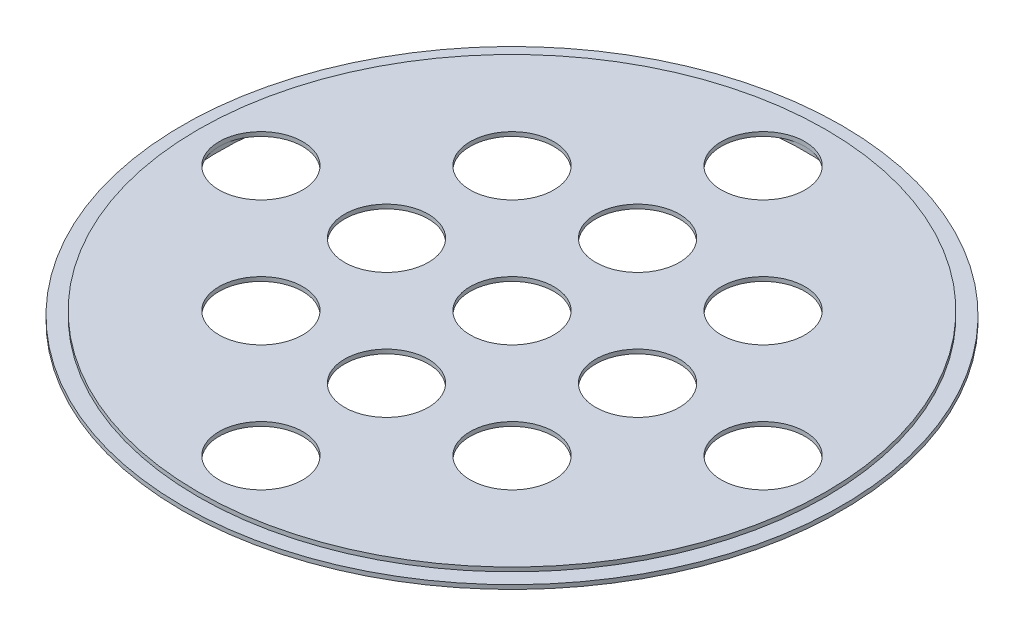
ISO-10303-21;
HEADER;
FILE_DESCRIPTION(('STEP AP214'),'2;1');
FILE_NAME('part.step','',(''),(''),'','','');
FILE_SCHEMA(('AUTOMOTIVE_DESIGN { 1 0 10303 214 1 1 1 1 }'));
ENDSEC;
DATA;
#1=APPLICATION_CONTEXT('core data for automotive mechanical design processes');
#2=APPLICATION_PROTOCOL_DEFINITION('international standard','automotive_design',2000,#1);
#3=PRODUCT_CONTEXT('',#1,'mechanical');
#4=PRODUCT('Part','Part','',(#3));
#5=PRODUCT_RELATED_PRODUCT_CATEGORY('part','',(#4));
#6=PRODUCT_DEFINITION_FORMATION('','',#4);
#7=PRODUCT_DEFINITION_CONTEXT('part definition',#1,'design');
#8=PRODUCT_DEFINITION('design','',#6,#7);
#9=PRODUCT_DEFINITION_SHAPE('','',#8);
#10=(LENGTH_UNIT() NAMED_UNIT(*) SI_UNIT(.MILLI.,.METRE.));
#11=(NAMED_UNIT(*) PLANE_ANGLE_UNIT() SI_UNIT($,.RADIAN.));
#12=(NAMED_UNIT(*) SI_UNIT($,.STERADIAN.) SOLID_ANGLE_UNIT());
#13=UNCERTAINTY_MEASURE_WITH_UNIT(LENGTH_MEASURE(1.E-05),#10,'distance_accuracy_value','');
#14=(GEOMETRIC_REPRESENTATION_CONTEXT(3) GLOBAL_UNCERTAINTY_ASSIGNED_CONTEXT((#13)) GLOBAL_UNIT_ASSIGNED_CONTEXT((#10,
#11,#12)) REPRESENTATION_CONTEXT('',''));
#15=CARTESIAN_POINT('',(0.,0.,0.));
#16=DIRECTION('',(0.,0.,1.));
#17=DIRECTION('',(1.,0.,0.));
#18=AXIS2_PLACEMENT_3D('',#15,#16,#17);
#19=CARTESIAN_POINT('',(0.,0.,0.));
#20=DIRECTION('',(0.,1.,0.));
#21=DIRECTION('',(0.,0.,1.));
#22=AXIS2_PLACEMENT_3D('',#19,#20,#21);
#23=PLANE('',#22);
#24=CARTESIAN_POINT('',(0.,0.,0.));
#25=DIRECTION('',(0.,1.,0.));
#26=DIRECTION('',(0.,0.,1.));
#27=AXIS2_PLACEMENT_3D('',#24,#25,#26);
#28=CIRCLE('',#27,1.);
#29=CARTESIAN_POINT('',(0.,0.,1.));
#30=VERTEX_POINT('',#29);
#31=EDGE_CURVE('E112',#30,#30,#28,.T.);
#32=ORIENTED_EDGE('',*,*,#31,.T.);
#33=EDGE_LOOP('',(#32));
#34=FACE_BOUND('',#33,.T.);
#35=CARTESIAN_POINT('',(3.00000000000001,0.,2.99999999999999));
#36=DIRECTION('',(0.,1.,0.));
#37=DIRECTION('',(0.,0.,1.));
#38=AXIS2_PLACEMENT_3D('',#35,#36,#37);
#39=CIRCLE('',#38,1.);
#40=CARTESIAN_POINT('',(3.00000000000001,0.,3.99999999999999));
#41=VERTEX_POINT('',#40);
#42=EDGE_CURVE('E80',#41,#41,#39,.T.);
#43=ORIENTED_EDGE('',*,*,#42,.T.);
#44=EDGE_LOOP('',(#43));
#45=FACE_BOUND('',#44,.T.);
#46=CARTESIAN_POINT('',(0.,0.,3.));
#47=DIRECTION('',(0.,1.,0.));
#48=DIRECTION('',(0.,0.,1.));
#49=AXIS2_PLACEMENT_3D('',#46,#47,#48);
#50=CIRCLE('',#49,1.);
#51=CARTESIAN_POINT('',(0.,0.,4.));
#52=VERTEX_POINT('',#51);
#53=EDGE_CURVE('E81',#52,#52,#50,.T.);
#54=ORIENTED_EDGE('',*,*,#53,.T.);
#55=EDGE_LOOP('',(#54));
#56=FACE_BOUND('',#55,.T.);
#57=CARTESIAN_POINT('',(-2.99999999999999,0.,3.00000000000001));
#58=DIRECTION('',(0.,1.,0.));
#59=DIRECTION('',(0.,0.,1.));
#60=AXIS2_PLACEMENT_3D('',#57,#58,#59);
#61=CIRCLE('',#60,1.);
#62=CARTESIAN_POINT('',(-2.99999999999999,0.,4.00000000000001));
#63=VERTEX_POINT('',#62);
#64=EDGE_CURVE('E87',#63,#63,#61,.T.);
#65=ORIENTED_EDGE('',*,*,#64,.T.);
#66=EDGE_LOOP('',(#65));
#67=FACE_BOUND('',#66,.T.);
#68=CARTESIAN_POINT('',(-3.,0.,0.));
#69=DIRECTION('',(0.,1.,0.));
#70=DIRECTION('',(0.,0.,1.));
#71=AXIS2_PLACEMENT_3D('',#68,#69,#70);
#72=CIRCLE('',#71,1.);
#73=CARTESIAN_POINT('',(-3.,0.,1.00000000000001));
#74=VERTEX_POINT('',#73);
#75=EDGE_CURVE('E93',#74,#74,#72,.T.);
#76=ORIENTED_EDGE('',*,*,#75,.T.);
#77=EDGE_LOOP('',(#76));
#78=FACE_BOUND('',#77,.T.);
#79=CARTESIAN_POINT('',(-3.00000000000001,0.,-2.99999999999999));
#80=DIRECTION('',(0.,1.,0.));
#81=DIRECTION('',(0.,0.,1.));
#82=AXIS2_PLACEMENT_3D('',#79,#80,#81);
#83=CIRCLE('',#82,1.);
#84=CARTESIAN_POINT('',(-3.00000000000001,0.,-1.99999999999999));
#85=VERTEX_POINT('',#84);
#86=EDGE_CURVE('E99',#85,#85,#83,.T.);
#87=ORIENTED_EDGE('',*,*,#86,.T.);
#88=EDGE_LOOP('',(#87));
#89=FACE_BOUND('',#88,.T.);
#90=CARTESIAN_POINT('',(0.,0.,-3.));
#91=DIRECTION('',(0.,1.,0.));
#92=DIRECTION('',(0.,0.,1.));
#93=AXIS2_PLACEMENT_3D('',#90,#91,#92);
#94=CIRCLE('',#93,1.);
#95=CARTESIAN_POINT('',(0.,0.,-2.));
#96=VERTEX_POINT('',#95);
#97=EDGE_CURVE('E105',#96,#96,#94,.T.);
#98=ORIENTED_EDGE('',*,*,#97,.T.);
#99=EDGE_LOOP('',(#98));
#100=FACE_BOUND('',#99,.T.);
#101=CARTESIAN_POINT('',(3.,0.,0.));
#102=DIRECTION('',(0.,1.,0.));
#103=DIRECTION('',(0.,0.,1.));
#104=AXIS2_PLACEMENT_3D('',#101,#102,#103);
#105=CIRCLE('',#104,1.);
#106=CARTESIAN_POINT('',(3.,0.,0.999999999999994));
#107=VERTEX_POINT('',#106);
#108=EDGE_CURVE('E70',#107,#107,#105,.T.);
#109=ORIENTED_EDGE('',*,*,#108,.T.);
#110=EDGE_LOOP('',(#109));
#111=FACE_BOUND('',#110,.T.);
#112=CARTESIAN_POINT('',(2.99999999999999,0.,-3.00000000000001));
#113=DIRECTION('',(0.,1.,0.));
#114=DIRECTION('',(0.,0.,1.));
#115=AXIS2_PLACEMENT_3D('',#112,#113,#114);
#116=CIRCLE('',#115,1.);
#117=CARTESIAN_POINT('',(2.99999999999999,0.,-2.00000000000001));
#118=VERTEX_POINT('',#117);
#119=EDGE_CURVE('E154',#118,#118,#116,.T.);
#120=ORIENTED_EDGE('',*,*,#119,.T.);
#121=EDGE_LOOP('',(#120));
#122=FACE_BOUND('',#121,.T.);
#123=CARTESIAN_POINT('',(0.,0.,0.));
#124=DIRECTION('',(0.,1.,0.));
#125=DIRECTION('',(0.,0.,1.));
#126=AXIS2_PLACEMENT_3D('',#123,#124,#125);
#127=CIRCLE('',#126,7.);
#128=CARTESIAN_POINT('',(0.,0.,7.));
#129=VERTEX_POINT('',#128);
#130=CARTESIAN_POINT('',(7.,0.,0.));
#131=VERTEX_POINT('',#130);
#132=EDGE_CURVE('E46',#129,#131,#127,.T.);
#133=ORIENTED_EDGE('',*,*,#132,.F.);
#134=CARTESIAN_POINT('',(0.,0.,6.));
#135=DIRECTION('',(0.,1.,0.));
#136=DIRECTION('',(0.,0.,1.));
#137=AXIS2_PLACEMENT_3D('',#134,#135,#136);
#138=CIRCLE('',#137,1.);
#139=EDGE_CURVE('E63',#129,#129,#138,.T.);
#140=ORIENTED_EDGE('',*,*,#139,.T.);
#141=CARTESIAN_POINT('',(-7.,0.,0.));
#142=VERTEX_POINT('',#141);
#143=EDGE_CURVE('E121',#142,#129,#127,.T.);
#144=ORIENTED_EDGE('',*,*,#143,.F.);
#145=CARTESIAN_POINT('',(-6.,0.,0.));
#146=DIRECTION('',(0.,1.,0.));
#147=DIRECTION('',(0.,0.,1.));
#148=AXIS2_PLACEMENT_3D('',#145,#146,#147);
#149=CIRCLE('',#148,1.);
#150=EDGE_CURVE('E73',#142,#142,#149,.T.);
#151=ORIENTED_EDGE('',*,*,#150,.T.);
#152=CARTESIAN_POINT('',(0.,0.,-7.));
#153=VERTEX_POINT('',#152);
#154=EDGE_CURVE('E44',#153,#142,#127,.T.);
#155=ORIENTED_EDGE('',*,*,#154,.F.);
#156=CARTESIAN_POINT('',(0.,0.,-6.));
#157=DIRECTION('',(0.,1.,0.));
#158=DIRECTION('',(0.,0.,1.));
#159=AXIS2_PLACEMENT_3D('',#156,#157,#158);
#160=CIRCLE('',#159,1.);
#161=EDGE_CURVE('E145',#153,#153,#160,.T.);
#162=ORIENTED_EDGE('',*,*,#161,.T.);
#163=EDGE_CURVE('E12',#131,#153,#127,.T.);
#164=ORIENTED_EDGE('',*,*,#163,.F.);
#165=CARTESIAN_POINT('',(6.,0.,0.));
#166=DIRECTION('',(0.,1.,0.));
#167=DIRECTION('',(0.,0.,1.));
#168=AXIS2_PLACEMENT_3D('',#165,#166,#167);
#169=CIRCLE('',#168,1.);
#170=EDGE_CURVE('E150',#131,#131,#169,.T.);
#171=ORIENTED_EDGE('',*,*,#170,.T.);
#172=EDGE_LOOP('',(#133,#140,#144,#151,#155,#162,#164,#171));
#173=FACE_BOUND('',#172,.T.);
#174=ADVANCED_FACE('F35',(#34,#45,#56,#67,#78,#89,#100,#111,#122,#173),#23,.F.);
#175=CARTESIAN_POINT('',(0.,0.1,0.));
#176=DIRECTION('',(0.,-1.,0.));
#177=DIRECTION('',(0.,0.,-1.));
#178=AXIS2_PLACEMENT_3D('',#175,#176,#177);
#179=CYLINDRICAL_SURFACE('',#178,7.5);
#180=CARTESIAN_POINT('',(0.,0.1,0.));
#181=DIRECTION('',(0.,1.,0.));
#182=DIRECTION('',(0.,0.,1.));
#183=AXIS2_PLACEMENT_3D('',#180,#181,#182);
#184=CIRCLE('',#183,7.5);
#185=CARTESIAN_POINT('',(0.,0.1,7.5));
#186=VERTEX_POINT('',#185);
#187=EDGE_CURVE('E118',#186,#186,#184,.T.);
#188=ORIENTED_EDGE('',*,*,#187,.F.);
#189=EDGE_LOOP('',(#188));
#190=FACE_BOUND('',#189,.T.);
#191=CARTESIAN_POINT('',(0.,0.,0.));
#192=DIRECTION('',(0.,1.,0.));
#193=DIRECTION('',(0.,0.,1.));
#194=AXIS2_PLACEMENT_3D('',#191,#192,#193);
#195=CIRCLE('',#194,7.5);
#196=CARTESIAN_POINT('',(0.,0.,7.5));
#197=VERTEX_POINT('',#196);
#198=EDGE_CURVE('E39',#197,#197,#195,.T.);
#199=ORIENTED_EDGE('',*,*,#198,.T.);
#200=EDGE_LOOP('',(#199));
#201=FACE_BOUND('',#200,.T.);
#202=ADVANCED_FACE('F37',(#190,#201),#179,.T.);
#203=CARTESIAN_POINT('',(0.,0.1,0.));
#204=DIRECTION('',(0.,1.,0.));
#205=DIRECTION('',(0.,0.,1.));
#206=AXIS2_PLACEMENT_3D('',#203,#204,#205);
#207=PLANE('',#206);
#208=CARTESIAN_POINT('',(2.99999999999999,0.1,-3.00000000000001));
#209=DIRECTION('',(0.,1.,0.));
#210=DIRECTION('',(0.,0.,1.));
#211=AXIS2_PLACEMENT_3D('',#208,#209,#210);
#212=CIRCLE('',#211,1.);
#213=CARTESIAN_POINT('',(2.99999999999999,0.1,-2.00000000000001));
#214=VERTEX_POINT('',#213);
#215=EDGE_CURVE('E108',#214,#214,#212,.T.);
#216=ORIENTED_EDGE('',*,*,#215,.F.);
#217=EDGE_LOOP('',(#216));
#218=FACE_BOUND('',#217,.T.);
#219=CARTESIAN_POINT('',(3.,0.1,0.));
#220=DIRECTION('',(0.,1.,0.));
#221=DIRECTION('',(0.,0.,1.));
#222=AXIS2_PLACEMENT_3D('',#219,#220,#221);
#223=CIRCLE('',#222,1.);
#224=CARTESIAN_POINT('',(3.,0.1,0.999999999999994));
#225=VERTEX_POINT('',#224);
#226=EDGE_CURVE('E157',#225,#225,#223,.T.);
#227=ORIENTED_EDGE('',*,*,#226,.F.);
#228=EDGE_LOOP('',(#227));
#229=FACE_BOUND('',#228,.T.);
#230=CARTESIAN_POINT('',(0.,0.1,6.));
#231=DIRECTION('',(0.,1.,0.));
#232=DIRECTION('',(0.,0.,1.));
#233=AXIS2_PLACEMENT_3D('',#230,#231,#232);
#234=CIRCLE('',#233,1.);
#235=CARTESIAN_POINT('',(0.,0.1,7.));
#236=VERTEX_POINT('',#235);
#237=EDGE_CURVE('E66',#236,#236,#234,.T.);
#238=ORIENTED_EDGE('',*,*,#237,.F.);
#239=EDGE_LOOP('',(#238));
#240=FACE_BOUND('',#239,.T.);
#241=CARTESIAN_POINT('',(-6.,0.1,0.));
#242=DIRECTION('',(0.,1.,0.));
#243=DIRECTION('',(0.,0.,1.));
#244=AXIS2_PLACEMENT_3D('',#241,#242,#243);
#245=CIRCLE('',#244,1.);
#246=CARTESIAN_POINT('',(-6.,0.1,1.00000000000001));
#247=VERTEX_POINT('',#246);
#248=EDGE_CURVE('E67',#247,#247,#245,.T.);
#249=ORIENTED_EDGE('',*,*,#248,.F.);
#250=EDGE_LOOP('',(#249));
#251=FACE_BOUND('',#250,.T.);
#252=CARTESIAN_POINT('',(0.,0.1,-6.));
#253=DIRECTION('',(0.,1.,0.));
#254=DIRECTION('',(0.,0.,1.));
#255=AXIS2_PLACEMENT_3D('',#252,#253,#254);
#256=CIRCLE('',#255,1.);
#257=CARTESIAN_POINT('',(0.,0.1,-5.));
#258=VERTEX_POINT('',#257);
#259=EDGE_CURVE('E142',#258,#258,#256,.T.);
#260=ORIENTED_EDGE('',*,*,#259,.F.);
#261=EDGE_LOOP('',(#260));
#262=FACE_BOUND('',#261,.T.);
#263=CARTESIAN_POINT('',(6.,0.1,0.));
#264=DIRECTION('',(0.,1.,0.));
#265=DIRECTION('',(0.,0.,1.));
#266=AXIS2_PLACEMENT_3D('',#263,#264,#265);
#267=CIRCLE('',#266,1.);
#268=CARTESIAN_POINT('',(6.,0.1,0.999999999999989));
#269=VERTEX_POINT('',#268);
#270=EDGE_CURVE('E147',#269,#269,#267,.T.);
#271=ORIENTED_EDGE('',*,*,#270,.F.);
#272=EDGE_LOOP('',(#271));
#273=FACE_BOUND('',#272,.T.);
#274=CARTESIAN_POINT('',(0.,0.1,-3.));
#275=DIRECTION('',(0.,1.,0.));
#276=DIRECTION('',(0.,0.,1.));
#277=AXIS2_PLACEMENT_3D('',#274,#275,#276);
#278=CIRCLE('',#277,1.);
#279=CARTESIAN_POINT('',(0.,0.1,-2.));
#280=VERTEX_POINT('',#279);
#281=EDGE_CURVE('E102',#280,#280,#278,.T.);
#282=ORIENTED_EDGE('',*,*,#281,.F.);
#283=EDGE_LOOP('',(#282));
#284=FACE_BOUND('',#283,.T.);
#285=CARTESIAN_POINT('',(-3.00000000000001,0.1,-2.99999999999999));
#286=DIRECTION('',(0.,1.,0.));
#287=DIRECTION('',(0.,0.,1.));
#288=AXIS2_PLACEMENT_3D('',#285,#286,#287);
#289=CIRCLE('',#288,1.);
#290=CARTESIAN_POINT('',(-3.00000000000001,0.1,-1.99999999999999));
#291=VERTEX_POINT('',#290);
#292=EDGE_CURVE('E96',#291,#291,#289,.T.);
#293=ORIENTED_EDGE('',*,*,#292,.F.);
#294=EDGE_LOOP('',(#293));
#295=FACE_BOUND('',#294,.T.);
#296=CARTESIAN_POINT('',(-3.,0.1,0.));
#297=DIRECTION('',(0.,1.,0.));
#298=DIRECTION('',(0.,0.,1.));
#299=AXIS2_PLACEMENT_3D('',#296,#297,#298);
#300=CIRCLE('',#299,1.);
#301=CARTESIAN_POINT('',(-3.,0.1,1.00000000000001));
#302=VERTEX_POINT('',#301);
#303=EDGE_CURVE('E90',#302,#302,#300,.T.);
#304=ORIENTED_EDGE('',*,*,#303,.F.);
#305=EDGE_LOOP('',(#304));
#306=FACE_BOUND('',#305,.T.);
#307=CARTESIAN_POINT('',(-2.99999999999999,0.1,3.00000000000001));
#308=DIRECTION('',(0.,1.,0.));
#309=DIRECTION('',(0.,0.,1.));
#310=AXIS2_PLACEMENT_3D('',#307,#308,#309);
#311=CIRCLE('',#310,1.);
#312=CARTESIAN_POINT('',(-2.99999999999999,0.1,4.00000000000001));
#313=VERTEX_POINT('',#312);
#314=EDGE_CURVE('E84',#313,#313,#311,.T.);
#315=ORIENTED_EDGE('',*,*,#314,.F.);
#316=EDGE_LOOP('',(#315));
#317=FACE_BOUND('',#316,.T.);
#318=CARTESIAN_POINT('',(0.,0.1,3.));
#319=DIRECTION('',(0.,1.,0.));
#320=DIRECTION('',(0.,0.,1.));
#321=AXIS2_PLACEMENT_3D('',#318,#319,#320);
#322=CIRCLE('',#321,1.);
#323=CARTESIAN_POINT('',(0.,0.1,4.));
#324=VERTEX_POINT('',#323);
#325=EDGE_CURVE('E77',#324,#324,#322,.T.);
#326=ORIENTED_EDGE('',*,*,#325,.F.);
#327=EDGE_LOOP('',(#326));
#328=FACE_BOUND('',#327,.T.);
#329=CARTESIAN_POINT('',(3.00000000000001,0.1,2.99999999999999));
#330=DIRECTION('',(0.,1.,0.));
#331=DIRECTION('',(0.,0.,1.));
#332=AXIS2_PLACEMENT_3D('',#329,#330,#331);
#333=CIRCLE('',#332,1.);
#334=CARTESIAN_POINT('',(3.00000000000001,0.1,3.99999999999999));
#335=VERTEX_POINT('',#334);
#336=EDGE_CURVE('E109',#335,#335,#333,.T.);
#337=ORIENTED_EDGE('',*,*,#336,.F.);
#338=EDGE_LOOP('',(#337));
#339=FACE_BOUND('',#338,.T.);
#340=CARTESIAN_POINT('',(0.,0.1,0.));
#341=DIRECTION('',(0.,1.,0.));
#342=DIRECTION('',(0.,0.,1.));
#343=AXIS2_PLACEMENT_3D('',#340,#341,#342);
#344=CIRCLE('',#343,1.);
#345=CARTESIAN_POINT('',(0.,0.1,1.));
#346=VERTEX_POINT('',#345);
#347=EDGE_CURVE('E115',#346,#346,#344,.T.);
#348=ORIENTED_EDGE('',*,*,#347,.F.);
#349=EDGE_LOOP('',(#348));
#350=FACE_BOUND('',#349,.T.);
#351=ORIENTED_EDGE('',*,*,#187,.T.);
#352=EDGE_LOOP('',(#351));
#353=FACE_BOUND('',#352,.T.);
#354=ADVANCED_FACE('F186',(#218,#229,#240,#251,#262,#273,#284,#295,#306,#317,#328,#339,#350,
#353),#207,.T.);
#355=CARTESIAN_POINT('',(0.,0.1,0.));
#356=DIRECTION('',(0.,-1.,0.));
#357=DIRECTION('',(0.,0.,-1.));
#358=AXIS2_PLACEMENT_3D('',#355,#356,#357);
#359=CYLINDRICAL_SURFACE('',#358,1.);
#360=ORIENTED_EDGE('',*,*,#347,.T.);
#361=EDGE_LOOP('',(#360));
#362=FACE_BOUND('',#361,.T.);
#363=ORIENTED_EDGE('',*,*,#31,.F.);
#364=EDGE_LOOP('',(#363));
#365=FACE_BOUND('',#364,.T.);
#366=ADVANCED_FACE('F192',(#362,#365),#359,.F.);
#367=CARTESIAN_POINT('',(3.00000000000001,0.1,2.99999999999999));
#368=DIRECTION('',(0.,-1.,0.));
#369=DIRECTION('',(0.,0.,-1.));
#370=AXIS2_PLACEMENT_3D('',#367,#368,#369);
#371=CYLINDRICAL_SURFACE('',#370,1.);
#372=ORIENTED_EDGE('',*,*,#336,.T.);
#373=EDGE_LOOP('',(#372));
#374=FACE_BOUND('',#373,.T.);
#375=ORIENTED_EDGE('',*,*,#42,.F.);
#376=EDGE_LOOP('',(#375));
#377=FACE_BOUND('',#376,.T.);
#378=ADVANCED_FACE('F196',(#374,#377),#371,.F.);
#379=CARTESIAN_POINT('',(0.,0.1,3.));
#380=DIRECTION('',(0.,-1.,0.));
#381=DIRECTION('',(0.,0.,-1.));
#382=AXIS2_PLACEMENT_3D('',#379,#380,#381);
#383=CYLINDRICAL_SURFACE('',#382,1.);
#384=ORIENTED_EDGE('',*,*,#325,.T.);
#385=EDGE_LOOP('',(#384));
#386=FACE_BOUND('',#385,.T.);
#387=ORIENTED_EDGE('',*,*,#53,.F.);
#388=EDGE_LOOP('',(#387));
#389=FACE_BOUND('',#388,.T.);
#390=ADVANCED_FACE('F200',(#386,#389),#383,.F.);
#391=CARTESIAN_POINT('',(-2.99999999999999,0.1,3.00000000000001));
#392=DIRECTION('',(0.,-1.,0.));
#393=DIRECTION('',(0.,0.,-1.));
#394=AXIS2_PLACEMENT_3D('',#391,#392,#393);
#395=CYLINDRICAL_SURFACE('',#394,1.);
#396=ORIENTED_EDGE('',*,*,#314,.T.);
#397=EDGE_LOOP('',(#396));
#398=FACE_BOUND('',#397,.T.);
#399=ORIENTED_EDGE('',*,*,#64,.F.);
#400=EDGE_LOOP('',(#399));
#401=FACE_BOUND('',#400,.T.);
#402=ADVANCED_FACE('F214',(#398,#401),#395,.F.);
#403=CARTESIAN_POINT('',(-3.,0.1,0.));
#404=DIRECTION('',(0.,-1.,0.));
#405=DIRECTION('',(0.,0.,-1.));
#406=AXIS2_PLACEMENT_3D('',#403,#404,#405);
#407=CYLINDRICAL_SURFACE('',#406,1.);
#408=ORIENTED_EDGE('',*,*,#303,.T.);
#409=EDGE_LOOP('',(#408));
#410=FACE_BOUND('',#409,.T.);
#411=ORIENTED_EDGE('',*,*,#75,.F.);
#412=EDGE_LOOP('',(#411));
#413=FACE_BOUND('',#412,.T.);
#414=ADVANCED_FACE('F210',(#410,#413),#407,.F.);
#415=CARTESIAN_POINT('',(-3.00000000000001,0.1,-2.99999999999999));
#416=DIRECTION('',(0.,-1.,0.));
#417=DIRECTION('',(0.,0.,-1.));
#418=AXIS2_PLACEMENT_3D('',#415,#416,#417);
#419=CYLINDRICAL_SURFACE('',#418,1.);
#420=ORIENTED_EDGE('',*,*,#292,.T.);
#421=EDGE_LOOP('',(#420));
#422=FACE_BOUND('',#421,.T.);
#423=ORIENTED_EDGE('',*,*,#86,.F.);
#424=EDGE_LOOP('',(#423));
#425=FACE_BOUND('',#424,.T.);
#426=ADVANCED_FACE('F206',(#422,#425),#419,.F.);
#427=CARTESIAN_POINT('',(0.,0.1,-3.));
#428=DIRECTION('',(0.,-1.,0.));
#429=DIRECTION('',(0.,0.,-1.));
#430=AXIS2_PLACEMENT_3D('',#427,#428,#429);
#431=CYLINDRICAL_SURFACE('',#430,1.);
#432=ORIENTED_EDGE('',*,*,#281,.T.);
#433=EDGE_LOOP('',(#432));
#434=FACE_BOUND('',#433,.T.);
#435=ORIENTED_EDGE('',*,*,#97,.F.);
#436=EDGE_LOOP('',(#435));
#437=FACE_BOUND('',#436,.T.);
#438=ADVANCED_FACE('F202',(#434,#437),#431,.F.);
#439=CARTESIAN_POINT('',(6.,0.1,0.));
#440=DIRECTION('',(0.,-1.,0.));
#441=DIRECTION('',(0.,0.,-1.));
#442=AXIS2_PLACEMENT_3D('',#439,#440,#441);
#443=CYLINDRICAL_SURFACE('',#442,1.);
#444=ORIENTED_EDGE('',*,*,#270,.T.);
#445=EDGE_LOOP('',(#444));
#446=FACE_BOUND('',#445,.T.);
#447=ORIENTED_EDGE('',*,*,#170,.F.);
#448=EDGE_LOOP('',(#447));
#449=FACE_BOUND('',#448,.T.);
#450=ADVANCED_FACE('F205',(#446,#449),#443,.F.);
#451=CARTESIAN_POINT('',(0.,0.1,-6.));
#452=DIRECTION('',(0.,-1.,0.));
#453=DIRECTION('',(0.,0.,-1.));
#454=AXIS2_PLACEMENT_3D('',#451,#452,#453);
#455=CYLINDRICAL_SURFACE('',#454,1.);
#456=ORIENTED_EDGE('',*,*,#259,.T.);
#457=EDGE_LOOP('',(#456));
#458=FACE_BOUND('',#457,.T.);
#459=ORIENTED_EDGE('',*,*,#161,.F.);
#460=EDGE_LOOP('',(#459));
#461=FACE_BOUND('',#460,.T.);
#462=ADVANCED_FACE('F272',(#458,#461),#455,.F.);
#463=CARTESIAN_POINT('',(-6.,0.1,0.));
#464=DIRECTION('',(0.,-1.,0.));
#465=DIRECTION('',(0.,0.,-1.));
#466=AXIS2_PLACEMENT_3D('',#463,#464,#465);
#467=CYLINDRICAL_SURFACE('',#466,1.);
#468=ORIENTED_EDGE('',*,*,#248,.T.);
#469=EDGE_LOOP('',(#468));
#470=FACE_BOUND('',#469,.T.);
#471=ORIENTED_EDGE('',*,*,#150,.F.);
#472=EDGE_LOOP('',(#471));
#473=FACE_BOUND('',#472,.T.);
#474=ADVANCED_FACE('F176',(#470,#473),#467,.F.);
#475=CARTESIAN_POINT('',(0.,0.1,6.));
#476=DIRECTION('',(0.,-1.,0.));
#477=DIRECTION('',(0.,0.,-1.));
#478=AXIS2_PLACEMENT_3D('',#475,#476,#477);
#479=CYLINDRICAL_SURFACE('',#478,1.);
#480=ORIENTED_EDGE('',*,*,#237,.T.);
#481=EDGE_LOOP('',(#480));
#482=FACE_BOUND('',#481,.T.);
#483=ORIENTED_EDGE('',*,*,#139,.F.);
#484=EDGE_LOOP('',(#483));
#485=FACE_BOUND('',#484,.T.);
#486=ADVANCED_FACE('F64',(#482,#485),#479,.F.);
#487=CARTESIAN_POINT('',(3.,0.1,0.));
#488=DIRECTION('',(0.,-1.,0.));
#489=DIRECTION('',(0.,0.,-1.));
#490=AXIS2_PLACEMENT_3D('',#487,#488,#489);
#491=CYLINDRICAL_SURFACE('',#490,1.);
#492=ORIENTED_EDGE('',*,*,#226,.T.);
#493=EDGE_LOOP('',(#492));
#494=FACE_BOUND('',#493,.T.);
#495=ORIENTED_EDGE('',*,*,#108,.F.);
#496=EDGE_LOOP('',(#495));
#497=FACE_BOUND('',#496,.T.);
#498=ADVANCED_FACE('F164',(#494,#497),#491,.F.);
#499=CARTESIAN_POINT('',(2.99999999999999,0.1,-3.00000000000001));
#500=DIRECTION('',(0.,-1.,0.));
#501=DIRECTION('',(0.,0.,-1.));
#502=AXIS2_PLACEMENT_3D('',#499,#500,#501);
#503=CYLINDRICAL_SURFACE('',#502,1.);
#504=ORIENTED_EDGE('',*,*,#215,.T.);
#505=EDGE_LOOP('',(#504));
#506=FACE_BOUND('',#505,.T.);
#507=ORIENTED_EDGE('',*,*,#119,.F.);
#508=EDGE_LOOP('',(#507));
#509=FACE_BOUND('',#508,.T.);
#510=ADVANCED_FACE('F166',(#506,#509),#503,.F.);
#511=CARTESIAN_POINT('',(0.,0.,0.));
#512=DIRECTION('',(0.,1.,0.));
#513=DIRECTION('',(0.,0.,1.));
#514=AXIS2_PLACEMENT_3D('',#511,#512,#513);
#515=PLANE('',#514);
#516=CARTESIAN_POINT('',(0.,0.,0.));
#517=DIRECTION('',(0.,1.,0.));
#518=DIRECTION('',(0.,0.,1.));
#519=AXIS2_PLACEMENT_3D('',#516,#517,#518);
#520=CIRCLE('',#519,7.87475199771764);
#521=CARTESIAN_POINT('',(0.,0.,7.87475199771764));
#522=VERTEX_POINT('',#521);
#523=EDGE_CURVE('E131',#522,#522,#520,.T.);
#524=ORIENTED_EDGE('',*,*,#523,.T.);
#525=EDGE_LOOP('',(#524));
#526=FACE_BOUND('',#525,.T.);
#527=ORIENTED_EDGE('',*,*,#198,.F.);
#528=EDGE_LOOP('',(#527));
#529=FACE_BOUND('',#528,.T.);
#530=ADVANCED_FACE('F173',(#526,#529),#515,.T.);
#531=CARTESIAN_POINT('',(0.,-0.1,0.));
#532=DIRECTION('',(0.,1.,0.));
#533=DIRECTION('',(0.,0.,1.));
#534=AXIS2_PLACEMENT_3D('',#531,#532,#533);
#535=CYLINDRICAL_SURFACE('',#534,7.87475199771764);
#536=CARTESIAN_POINT('',(0.,-0.1,0.));
#537=DIRECTION('',(0.,1.,0.));
#538=DIRECTION('',(0.,0.,1.));
#539=AXIS2_PLACEMENT_3D('',#536,#537,#538);
#540=CIRCLE('',#539,7.87475199771764);
#541=CARTESIAN_POINT('',(0.,-0.1,7.87475199771764));
#542=VERTEX_POINT('',#541);
#543=EDGE_CURVE('E135',#542,#542,#540,.T.);
#544=ORIENTED_EDGE('',*,*,#543,.T.);
#545=EDGE_LOOP('',(#544));
#546=FACE_BOUND('',#545,.T.);
#547=ORIENTED_EDGE('',*,*,#523,.F.);
#548=EDGE_LOOP('',(#547));
#549=FACE_BOUND('',#548,.T.);
#550=ADVANCED_FACE('F302',(#546,#549),#535,.T.);
#551=CARTESIAN_POINT('',(0.,-0.1,0.));
#552=DIRECTION('',(0.,1.,0.));
#553=DIRECTION('',(0.,0.,1.));
#554=AXIS2_PLACEMENT_3D('',#551,#552,#553);
#555=PLANE('',#554);
#556=CARTESIAN_POINT('',(0.,-0.1,0.));
#557=DIRECTION('',(0.,1.,0.));
#558=DIRECTION('',(0.,0.,1.));
#559=AXIS2_PLACEMENT_3D('',#556,#557,#558);
#560=CIRCLE('',#559,7.);
#561=CARTESIAN_POINT('',(0.,-0.1,7.));
#562=VERTEX_POINT('',#561);
#563=EDGE_CURVE('E129',#562,#562,#560,.T.);
#564=ORIENTED_EDGE('',*,*,#563,.T.);
#565=EDGE_LOOP('',(#564));
#566=FACE_BOUND('',#565,.T.);
#567=ORIENTED_EDGE('',*,*,#543,.F.);
#568=EDGE_LOOP('',(#567));
#569=FACE_BOUND('',#568,.T.);
#570=ADVANCED_FACE('F311',(#566,#569),#555,.F.);
#571=CARTESIAN_POINT('',(0.,-0.1,0.));
#572=DIRECTION('',(0.,1.,0.));
#573=DIRECTION('',(0.,0.,1.));
#574=AXIS2_PLACEMENT_3D('',#571,#572,#573);
#575=CYLINDRICAL_SURFACE('',#574,7.);
#576=ORIENTED_EDGE('',*,*,#563,.F.);
#577=EDGE_LOOP('',(#576));
#578=FACE_BOUND('',#577,.T.);
#579=ORIENTED_EDGE('',*,*,#132,.T.);
#580=ORIENTED_EDGE('',*,*,#163,.T.);
#581=ORIENTED_EDGE('',*,*,#154,.T.);
#582=ORIENTED_EDGE('',*,*,#143,.T.);
#583=EDGE_LOOP('',(#579,#580,#581,#582));
#584=FACE_BOUND('',#583,.T.);
#585=ADVANCED_FACE('F321',(#578,#584),#575,.F.);
#586=CLOSED_SHELL('',(#174,#202,#354,#366,#378,#390,#402,#414,#426,#438,#450,#462,#474,#486,
#498,#510,#530,#550,#570,#585));
#587=MANIFOLD_SOLID_BREP('B2',#586);
#588=ADVANCED_BREP_SHAPE_REPRESENTATION('',(#18,#587),#14);
#589=SHAPE_DEFINITION_REPRESENTATION(#9,#588);
ENDSEC;
END-ISO-10303-21;
